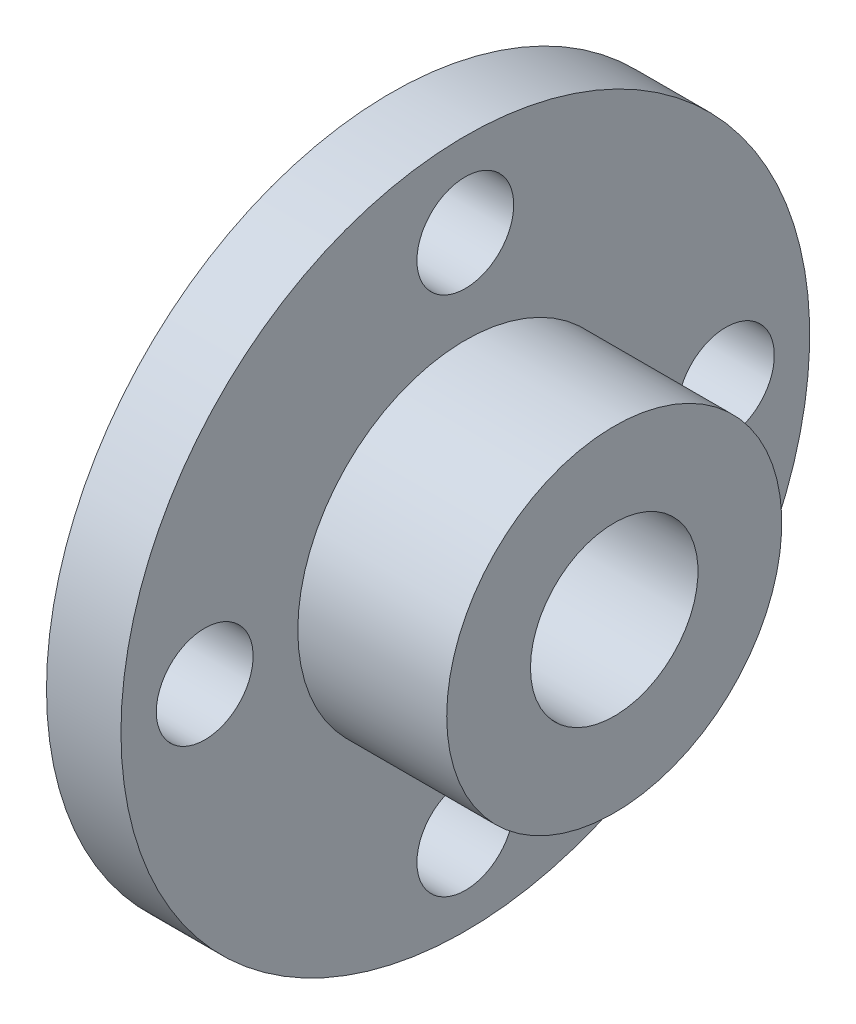
ISO-10303-21;
HEADER;
FILE_DESCRIPTION(('STEP AP214'),'2;1');
FILE_NAME('part.step','',(''),(''),'','','');
FILE_SCHEMA(('AUTOMOTIVE_DESIGN { 1 0 10303 214 1 1 1 1 }'));
ENDSEC;
DATA;
#1=APPLICATION_CONTEXT('core data for automotive mechanical design processes');
#2=APPLICATION_PROTOCOL_DEFINITION('international standard','automotive_design',2000,#1);
#3=PRODUCT_CONTEXT('',#1,'mechanical');
#4=PRODUCT('Part','Part','',(#3));
#5=PRODUCT_RELATED_PRODUCT_CATEGORY('part','',(#4));
#6=PRODUCT_DEFINITION_FORMATION('','',#4);
#7=PRODUCT_DEFINITION_CONTEXT('part definition',#1,'design');
#8=PRODUCT_DEFINITION('design','',#6,#7);
#9=PRODUCT_DEFINITION_SHAPE('','',#8);
#10=(LENGTH_UNIT() NAMED_UNIT(*) SI_UNIT(.MILLI.,.METRE.));
#11=(NAMED_UNIT(*) PLANE_ANGLE_UNIT() SI_UNIT($,.RADIAN.));
#12=(NAMED_UNIT(*) SI_UNIT($,.STERADIAN.) SOLID_ANGLE_UNIT());
#13=UNCERTAINTY_MEASURE_WITH_UNIT(LENGTH_MEASURE(1.E-05),#10,'distance_accuracy_value','');
#14=(GEOMETRIC_REPRESENTATION_CONTEXT(3) GLOBAL_UNCERTAINTY_ASSIGNED_CONTEXT((#13)) GLOBAL_UNIT_ASSIGNED_CONTEXT((#10,
#11,#12)) REPRESENTATION_CONTEXT('',''));
#15=CARTESIAN_POINT('',(0.,0.,0.));
#16=DIRECTION('',(0.,0.,1.));
#17=DIRECTION('',(1.,0.,0.));
#18=AXIS2_PLACEMENT_3D('',#15,#16,#17);
#19=CARTESIAN_POINT('',(-16.9594650205761,0.,0.));
#20=DIRECTION('',(-1.,0.,0.));
#21=DIRECTION('',(0.,0.,1.));
#22=AXIS2_PLACEMENT_3D('',#19,#20,#21);
#23=CYLINDRICAL_SURFACE('',#22,45.);
#24=CARTESIAN_POINT('',(0.,0.,0.));
#25=DIRECTION('',(-1.,0.,0.));
#26=DIRECTION('',(0.,0.,1.));
#27=AXIS2_PLACEMENT_3D('',#24,#25,#26);
#28=CIRCLE('',#27,45.);
#29=CARTESIAN_POINT('',(0.,0.,45.));
#30=VERTEX_POINT('',#29);
#31=EDGE_CURVE('E18',#30,#30,#28,.F.);
#32=ORIENTED_EDGE('',*,*,#31,.T.);
#33=EDGE_LOOP('',(#32));
#34=FACE_BOUND('',#33,.T.);
#35=CARTESIAN_POINT('',(40.,0.,0.));
#36=DIRECTION('',(-1.,0.,0.));
#37=DIRECTION('',(0.,0.,1.));
#38=AXIS2_PLACEMENT_3D('',#35,#36,#37);
#39=CIRCLE('',#38,45.);
#40=CARTESIAN_POINT('',(40.,0.,45.));
#41=VERTEX_POINT('',#40);
#42=EDGE_CURVE('E58',#41,#41,#39,.T.);
#43=ORIENTED_EDGE('',*,*,#42,.T.);
#44=EDGE_LOOP('',(#43));
#45=FACE_BOUND('',#44,.T.);
#46=ADVANCED_FACE('F15',(#34,#45),#23,.T.);
#47=CARTESIAN_POINT('',(0.,92.5,0.));
#48=DIRECTION('',(-1.,0.,0.));
#49=DIRECTION('',(0.,0.,1.));
#50=AXIS2_PLACEMENT_3D('',#47,#48,#49);
#51=PLANE('',#50);
#52=CARTESIAN_POINT('',(0.,7.33211081157058E-13,-70.));
#53=DIRECTION('',(-1.,0.,0.));
#54=DIRECTION('',(0.,0.,1.));
#55=AXIS2_PLACEMENT_3D('',#52,#53,#54);
#56=CIRCLE('',#55,13.);
#57=CARTESIAN_POINT('',(0.,7.33211081157058E-13,-57.));
#58=VERTEX_POINT('',#57);
#59=EDGE_CURVE('E56',#58,#58,#56,.T.);
#60=ORIENTED_EDGE('',*,*,#59,.T.);
#61=EDGE_LOOP('',(#60));
#62=FACE_BOUND('',#61,.T.);
#63=CARTESIAN_POINT('',(0.,-2.44403693719019E-13,70.));
#64=DIRECTION('',(-1.,0.,0.));
#65=DIRECTION('',(0.,0.,1.));
#66=AXIS2_PLACEMENT_3D('',#63,#64,#65);
#67=CIRCLE('',#66,13.);
#68=CARTESIAN_POINT('',(0.,-2.44403693719019E-13,83.));
#69=VERTEX_POINT('',#68);
#70=EDGE_CURVE('E53',#69,#69,#67,.T.);
#71=ORIENTED_EDGE('',*,*,#70,.T.);
#72=EDGE_LOOP('',(#71));
#73=FACE_BOUND('',#72,.T.);
#74=ORIENTED_EDGE('',*,*,#31,.F.);
#75=EDGE_LOOP('',(#74));
#76=FACE_BOUND('',#75,.T.);
#77=CARTESIAN_POINT('',(0.,0.,0.));
#78=DIRECTION('',(-1.,0.,0.));
#79=DIRECTION('',(0.,0.,1.));
#80=AXIS2_PLACEMENT_3D('',#77,#78,#79);
#81=CIRCLE('',#80,92.5);
#82=CARTESIAN_POINT('',(0.,0.,92.5));
#83=VERTEX_POINT('',#82);
#84=EDGE_CURVE('E50',#83,#83,#81,.T.);
#85=ORIENTED_EDGE('',*,*,#84,.F.);
#86=EDGE_LOOP('',(#85));
#87=FACE_BOUND('',#86,.T.);
#88=CARTESIAN_POINT('',(0.,70.,0.));
#89=DIRECTION('',(-1.,0.,0.));
#90=DIRECTION('',(0.,0.,1.));
#91=AXIS2_PLACEMENT_3D('',#88,#89,#90);
#92=CIRCLE('',#91,13.);
#93=CARTESIAN_POINT('',(0.,70.,13.));
#94=VERTEX_POINT('',#93);
#95=EDGE_CURVE('E47',#94,#94,#92,.T.);
#96=ORIENTED_EDGE('',*,*,#95,.T.);
#97=EDGE_LOOP('',(#96));
#98=FACE_BOUND('',#97,.T.);
#99=CARTESIAN_POINT('',(0.,-70.,-4.88807387438039E-13));
#100=DIRECTION('',(-1.,0.,0.));
#101=DIRECTION('',(0.,0.,1.));
#102=AXIS2_PLACEMENT_3D('',#99,#100,#101);
#103=CIRCLE('',#102,13.);
#104=CARTESIAN_POINT('',(0.,-70.,12.9999999999995));
#105=VERTEX_POINT('',#104);
#106=EDGE_CURVE('E44',#105,#105,#103,.T.);
#107=ORIENTED_EDGE('',*,*,#106,.T.);
#108=EDGE_LOOP('',(#107));
#109=FACE_BOUND('',#108,.T.);
#110=ADVANCED_FACE('F66',(#62,#73,#76,#87,#98,#109),#51,.F.);
#111=CARTESIAN_POINT('',(40.,45.,0.));
#112=DIRECTION('',(-1.,0.,0.));
#113=DIRECTION('',(0.,0.,1.));
#114=AXIS2_PLACEMENT_3D('',#111,#112,#113);
#115=PLANE('',#114);
#116=CARTESIAN_POINT('',(40.,0.,0.));
#117=DIRECTION('',(-1.,0.,0.));
#118=DIRECTION('',(0.,0.,1.));
#119=AXIS2_PLACEMENT_3D('',#116,#117,#118);
#120=CIRCLE('',#119,22.5);
#121=CARTESIAN_POINT('',(40.,0.,22.5));
#122=VERTEX_POINT('',#121);
#123=EDGE_CURVE('E41',#122,#122,#120,.T.);
#124=ORIENTED_EDGE('',*,*,#123,.T.);
#125=EDGE_LOOP('',(#124));
#126=FACE_BOUND('',#125,.T.);
#127=ORIENTED_EDGE('',*,*,#42,.F.);
#128=EDGE_LOOP('',(#127));
#129=FACE_BOUND('',#128,.T.);
#130=ADVANCED_FACE('F69',(#126,#129),#115,.F.);
#131=CARTESIAN_POINT('',(40.,7.33211081157058E-13,-70.));
#132=DIRECTION('',(-1.,0.,0.));
#133=DIRECTION('',(0.,0.,1.));
#134=AXIS2_PLACEMENT_3D('',#131,#132,#133);
#135=CYLINDRICAL_SURFACE('',#134,13.);
#136=CARTESIAN_POINT('',(-20.,7.33211081157058E-13,-70.));
#137=DIRECTION('',(-1.,0.,0.));
#138=DIRECTION('',(0.,0.,1.));
#139=AXIS2_PLACEMENT_3D('',#136,#137,#138);
#140=CIRCLE('',#139,13.);
#141=CARTESIAN_POINT('',(-20.,7.33211081157058E-13,-57.));
#142=VERTEX_POINT('',#141);
#143=EDGE_CURVE('E38',#142,#142,#140,.T.);
#144=ORIENTED_EDGE('',*,*,#143,.T.);
#145=EDGE_LOOP('',(#144));
#146=FACE_BOUND('',#145,.T.);
#147=ORIENTED_EDGE('',*,*,#59,.F.);
#148=EDGE_LOOP('',(#147));
#149=FACE_BOUND('',#148,.T.);
#150=ADVANCED_FACE('F110',(#146,#149),#135,.F.);
#151=CARTESIAN_POINT('',(40.,-2.44403693719019E-13,70.));
#152=DIRECTION('',(-1.,0.,0.));
#153=DIRECTION('',(0.,0.,1.));
#154=AXIS2_PLACEMENT_3D('',#151,#152,#153);
#155=CYLINDRICAL_SURFACE('',#154,13.);
#156=CARTESIAN_POINT('',(-20.,-2.44403693719019E-13,70.));
#157=DIRECTION('',(-1.,0.,0.));
#158=DIRECTION('',(0.,0.,1.));
#159=AXIS2_PLACEMENT_3D('',#156,#157,#158);
#160=CIRCLE('',#159,13.);
#161=CARTESIAN_POINT('',(-20.,-2.44403693719019E-13,83.));
#162=VERTEX_POINT('',#161);
#163=EDGE_CURVE('E35',#162,#162,#160,.T.);
#164=ORIENTED_EDGE('',*,*,#163,.T.);
#165=EDGE_LOOP('',(#164));
#166=FACE_BOUND('',#165,.T.);
#167=ORIENTED_EDGE('',*,*,#70,.F.);
#168=EDGE_LOOP('',(#167));
#169=FACE_BOUND('',#168,.T.);
#170=ADVANCED_FACE('F113',(#166,#169),#155,.F.);
#171=CARTESIAN_POINT('',(-16.9594650205761,0.,0.));
#172=DIRECTION('',(-1.,0.,0.));
#173=DIRECTION('',(0.,0.,1.));
#174=AXIS2_PLACEMENT_3D('',#171,#172,#173);
#175=CYLINDRICAL_SURFACE('',#174,92.5);
#176=CARTESIAN_POINT('',(-20.,0.,0.));
#177=DIRECTION('',(-1.,0.,0.));
#178=DIRECTION('',(0.,0.,1.));
#179=AXIS2_PLACEMENT_3D('',#176,#177,#178);
#180=CIRCLE('',#179,92.5);
#181=CARTESIAN_POINT('',(-20.,0.,92.5));
#182=VERTEX_POINT('',#181);
#183=EDGE_CURVE('E32',#182,#182,#180,.F.);
#184=ORIENTED_EDGE('',*,*,#183,.T.);
#185=EDGE_LOOP('',(#184));
#186=FACE_BOUND('',#185,.T.);
#187=ORIENTED_EDGE('',*,*,#84,.T.);
#188=EDGE_LOOP('',(#187));
#189=FACE_BOUND('',#188,.T.);
#190=ADVANCED_FACE('F91',(#186,#189),#175,.T.);
#191=CARTESIAN_POINT('',(40.,70.,0.));
#192=DIRECTION('',(-1.,0.,0.));
#193=DIRECTION('',(0.,0.,1.));
#194=AXIS2_PLACEMENT_3D('',#191,#192,#193);
#195=CYLINDRICAL_SURFACE('',#194,13.);
#196=CARTESIAN_POINT('',(-20.,70.,0.));
#197=DIRECTION('',(-1.,0.,0.));
#198=DIRECTION('',(0.,0.,1.));
#199=AXIS2_PLACEMENT_3D('',#196,#197,#198);
#200=CIRCLE('',#199,13.);
#201=CARTESIAN_POINT('',(-20.,70.,13.));
#202=VERTEX_POINT('',#201);
#203=EDGE_CURVE('E27',#202,#202,#200,.T.);
#204=ORIENTED_EDGE('',*,*,#203,.T.);
#205=EDGE_LOOP('',(#204));
#206=FACE_BOUND('',#205,.T.);
#207=ORIENTED_EDGE('',*,*,#95,.F.);
#208=EDGE_LOOP('',(#207));
#209=FACE_BOUND('',#208,.T.);
#210=ADVANCED_FACE('F80',(#206,#209),#195,.F.);
#211=CARTESIAN_POINT('',(40.,-70.,-4.88807387438039E-13));
#212=DIRECTION('',(-1.,0.,0.));
#213=DIRECTION('',(0.,0.,1.));
#214=AXIS2_PLACEMENT_3D('',#211,#212,#213);
#215=CYLINDRICAL_SURFACE('',#214,13.);
#216=CARTESIAN_POINT('',(-20.,-70.,-4.88807387438039E-13));
#217=DIRECTION('',(-1.,0.,0.));
#218=DIRECTION('',(0.,0.,1.));
#219=AXIS2_PLACEMENT_3D('',#216,#217,#218);
#220=CIRCLE('',#219,13.);
#221=CARTESIAN_POINT('',(-20.,-70.,12.9999999999995));
#222=VERTEX_POINT('',#221);
#223=EDGE_CURVE('E22',#222,#222,#220,.T.);
#224=ORIENTED_EDGE('',*,*,#223,.T.);
#225=EDGE_LOOP('',(#224));
#226=FACE_BOUND('',#225,.T.);
#227=ORIENTED_EDGE('',*,*,#106,.F.);
#228=EDGE_LOOP('',(#227));
#229=FACE_BOUND('',#228,.T.);
#230=ADVANCED_FACE('F77',(#226,#229),#215,.F.);
#231=CARTESIAN_POINT('',(-9.48503389009925,0.,0.));
#232=DIRECTION('',(-1.,0.,0.));
#233=DIRECTION('',(0.,0.,1.));
#234=AXIS2_PLACEMENT_3D('',#231,#232,#233);
#235=CYLINDRICAL_SURFACE('',#234,22.5);
#236=ORIENTED_EDGE('',*,*,#123,.F.);
#237=EDGE_LOOP('',(#236));
#238=FACE_BOUND('',#237,.T.);
#239=CARTESIAN_POINT('',(-20.,0.,0.));
#240=DIRECTION('',(-1.,0.,0.));
#241=DIRECTION('',(0.,0.,1.));
#242=AXIS2_PLACEMENT_3D('',#239,#240,#241);
#243=CIRCLE('',#242,22.5);
#244=CARTESIAN_POINT('',(-20.,0.,22.5));
#245=VERTEX_POINT('',#244);
#246=EDGE_CURVE('E10',#245,#245,#243,.T.);
#247=ORIENTED_EDGE('',*,*,#246,.T.);
#248=EDGE_LOOP('',(#247));
#249=FACE_BOUND('',#248,.T.);
#250=ADVANCED_FACE('F79',(#238,#249),#235,.F.);
#251=CARTESIAN_POINT('',(-20.,0.,0.));
#252=DIRECTION('',(1.,0.,0.));
#253=DIRECTION('',(0.,0.,-1.));
#254=AXIS2_PLACEMENT_3D('',#251,#252,#253);
#255=PLANE('',#254);
#256=ORIENTED_EDGE('',*,*,#246,.F.);
#257=EDGE_LOOP('',(#256));
#258=FACE_BOUND('',#257,.T.);
#259=ORIENTED_EDGE('',*,*,#223,.F.);
#260=EDGE_LOOP('',(#259));
#261=FACE_BOUND('',#260,.T.);
#262=ORIENTED_EDGE('',*,*,#203,.F.);
#263=EDGE_LOOP('',(#262));
#264=FACE_BOUND('',#263,.T.);
#265=ORIENTED_EDGE('',*,*,#183,.F.);
#266=EDGE_LOOP('',(#265));
#267=FACE_BOUND('',#266,.T.);
#268=ORIENTED_EDGE('',*,*,#163,.F.);
#269=EDGE_LOOP('',(#268));
#270=FACE_BOUND('',#269,.T.);
#271=ORIENTED_EDGE('',*,*,#143,.F.);
#272=EDGE_LOOP('',(#271));
#273=FACE_BOUND('',#272,.T.);
#274=ADVANCED_FACE('F88',(#258,#261,#264,#267,#270,#273),#255,.F.);
#275=CLOSED_SHELL('',(#46,#110,#130,#150,#170,#190,#210,#230,#250,#274));
#276=MANIFOLD_SOLID_BREP('B1',#275);
#277=ADVANCED_BREP_SHAPE_REPRESENTATION('',(#18,#276),#14);
#278=SHAPE_DEFINITION_REPRESENTATION(#9,#277);
ENDSEC;
END-ISO-10303-21;
